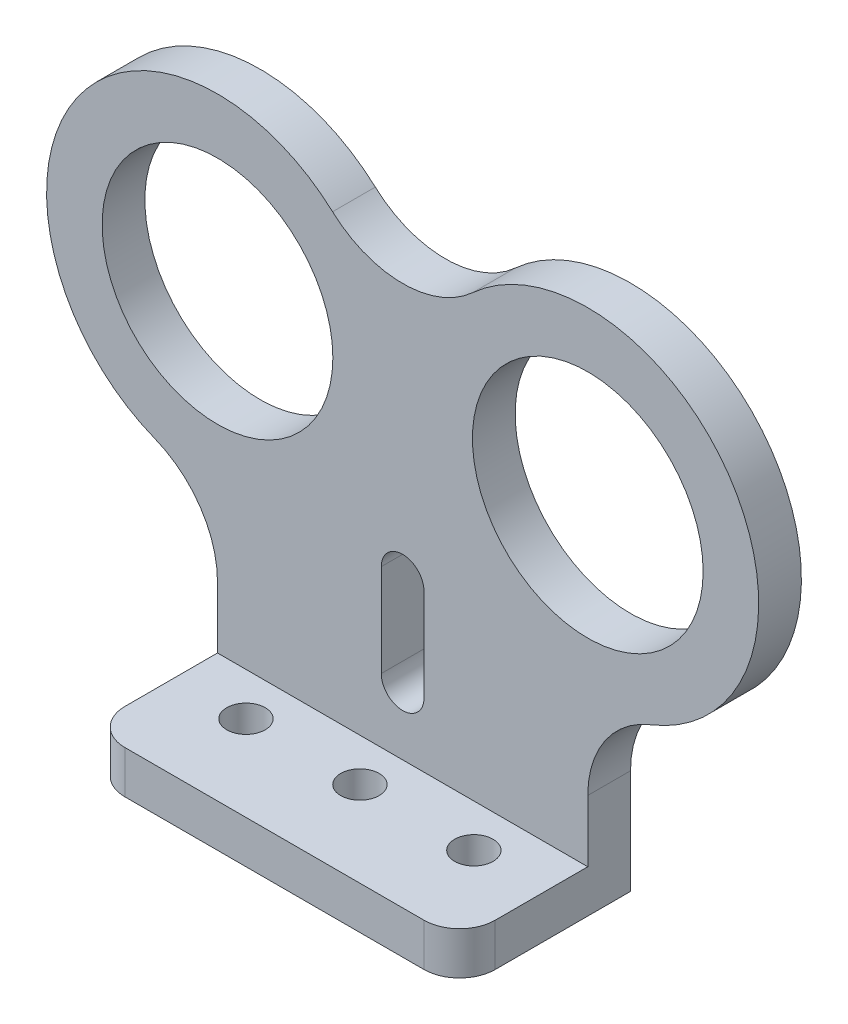
ISO-10303-21;
HEADER;
FILE_DESCRIPTION(('STEP AP214'),'2;1');
FILE_NAME('part.step','',(''),(''),'','','');
FILE_SCHEMA(('AUTOMOTIVE_DESIGN { 1 0 10303 214 1 1 1 1 }'));
ENDSEC;
DATA;
#1=APPLICATION_CONTEXT('core data for automotive mechanical design processes');
#2=APPLICATION_PROTOCOL_DEFINITION('international standard','automotive_design',2000,#1);
#3=PRODUCT_CONTEXT('',#1,'mechanical');
#4=PRODUCT('Part','Part','',(#3));
#5=PRODUCT_RELATED_PRODUCT_CATEGORY('part','',(#4));
#6=PRODUCT_DEFINITION_FORMATION('','',#4);
#7=PRODUCT_DEFINITION_CONTEXT('part definition',#1,'design');
#8=PRODUCT_DEFINITION('design','',#6,#7);
#9=PRODUCT_DEFINITION_SHAPE('','',#8);
#10=(LENGTH_UNIT() NAMED_UNIT(*) SI_UNIT(.MILLI.,.METRE.));
#11=(NAMED_UNIT(*) PLANE_ANGLE_UNIT() SI_UNIT($,.RADIAN.));
#12=(NAMED_UNIT(*) SI_UNIT($,.STERADIAN.) SOLID_ANGLE_UNIT());
#13=UNCERTAINTY_MEASURE_WITH_UNIT(LENGTH_MEASURE(1.E-05),#10,'distance_accuracy_value','');
#14=(GEOMETRIC_REPRESENTATION_CONTEXT(3) GLOBAL_UNCERTAINTY_ASSIGNED_CONTEXT((#13)) GLOBAL_UNIT_ASSIGNED_CONTEXT((#10,
#11,#12)) REPRESENTATION_CONTEXT('',''));
#15=CARTESIAN_POINT('',(0.,0.,0.));
#16=DIRECTION('',(0.,0.,1.));
#17=DIRECTION('',(1.,0.,0.));
#18=AXIS2_PLACEMENT_3D('',#15,#16,#17);
#19=CARTESIAN_POINT('',(0.,0.,3.));
#20=DIRECTION('',(0.,0.,1.));
#21=DIRECTION('',(1.,0.,0.));
#22=AXIS2_PLACEMENT_3D('',#19,#20,#21);
#23=PLANE('',#22);
#24=CARTESIAN_POINT('',(0.,7.5,3.));
#25=DIRECTION('',(0.,0.,1.));
#26=DIRECTION('',(1.,0.,0.));
#27=AXIS2_PLACEMENT_3D('',#24,#25,#26);
#28=CIRCLE('',#27,1.5);
#29=CARTESIAN_POINT('',(-1.5,7.5,3.));
#30=VERTEX_POINT('',#29);
#31=CARTESIAN_POINT('',(1.5,7.5,3.));
#32=VERTEX_POINT('',#31);
#33=EDGE_CURVE('E245',#30,#32,#28,.T.);
#34=ORIENTED_EDGE('',*,*,#33,.F.);
#35=DIRECTION('',(0.,-1.,0.));
#36=VECTOR('',#35,1.);
#37=CARTESIAN_POINT('',(-1.5,0.,3.));
#38=LINE('',#37,#36);
#39=CARTESIAN_POINT('',(-1.5,14.,3.));
#40=VERTEX_POINT('',#39);
#41=EDGE_CURVE('E276',#40,#30,#38,.T.);
#42=ORIENTED_EDGE('',*,*,#41,.F.);
#43=CARTESIAN_POINT('',(0.,14.,3.));
#44=DIRECTION('',(0.,0.,1.));
#45=DIRECTION('',(1.,0.,0.));
#46=AXIS2_PLACEMENT_3D('',#43,#44,#45);
#47=CIRCLE('',#46,1.5);
#48=CARTESIAN_POINT('',(1.5,14.,3.));
#49=VERTEX_POINT('',#48);
#50=EDGE_CURVE('E285',#49,#40,#47,.T.);
#51=ORIENTED_EDGE('',*,*,#50,.F.);
#52=DIRECTION('',(0.,-1.,0.));
#53=VECTOR('',#52,1.);
#54=CARTESIAN_POINT('',(1.5,0.,3.));
#55=LINE('',#54,#53);
#56=EDGE_CURVE('E287',#49,#32,#55,.T.);
#57=ORIENTED_EDGE('',*,*,#56,.T.);
#58=EDGE_LOOP('',(#34,#42,#51,#57));
#59=FACE_BOUND('',#58,.T.);
#60=CARTESIAN_POINT('',(13.,25.,3.));
#61=DIRECTION('',(0.,0.,1.));
#62=DIRECTION('',(1.,0.,0.));
#63=AXIS2_PLACEMENT_3D('',#60,#61,#62);
#64=CIRCLE('',#63,8.10000000000002);
#65=CARTESIAN_POINT('',(21.1,25.,3.));
#66=VERTEX_POINT('',#65);
#67=EDGE_CURVE('E183',#66,#66,#64,.T.);
#68=ORIENTED_EDGE('',*,*,#67,.F.);
#69=EDGE_LOOP('',(#68));
#70=FACE_BOUND('',#69,.T.);
#71=CARTESIAN_POINT('',(-13.,25.,3.));
#72=DIRECTION('',(0.,0.,1.));
#73=DIRECTION('',(1.,0.,0.));
#74=AXIS2_PLACEMENT_3D('',#71,#72,#73);
#75=CIRCLE('',#74,8.10000000000002);
#76=CARTESIAN_POINT('',(-4.89999999999998,25.,3.));
#77=VERTEX_POINT('',#76);
#78=EDGE_CURVE('E187',#77,#77,#75,.F.);
#79=ORIENTED_EDGE('',*,*,#78,.T.);
#80=EDGE_LOOP('',(#79));
#81=FACE_BOUND('',#80,.T.);
#82=DIRECTION('',(0.,-1.,0.));
#83=VECTOR('',#82,1.);
#84=CARTESIAN_POINT('',(-13.,0.,3.));
#85=LINE('',#84,#83);
#86=CARTESIAN_POINT('',(-13.,7.3364782673443,3.));
#87=VERTEX_POINT('',#86);
#88=CARTESIAN_POINT('',(-13.,3.,3.));
#89=VERTEX_POINT('',#88);
#90=EDGE_CURVE('E165',#87,#89,#85,.T.);
#91=ORIENTED_EDGE('',*,*,#90,.T.);
#92=DIRECTION('',(1.,0.,0.));
#93=VECTOR('',#92,1.);
#94=CARTESIAN_POINT('',(-13.,3.,3.));
#95=LINE('',#94,#93);
#96=CARTESIAN_POINT('',(13.,3.,3.));
#97=VERTEX_POINT('',#96);
#98=EDGE_CURVE('E320',#89,#97,#95,.T.);
#99=ORIENTED_EDGE('',*,*,#98,.T.);
#100=DIRECTION('',(0.,-1.,0.));
#101=VECTOR('',#100,1.);
#102=CARTESIAN_POINT('',(13.,0.,3.));
#103=LINE('',#102,#101);
#104=CARTESIAN_POINT('',(13.,7.3364782673443,3.));
#105=VERTEX_POINT('',#104);
#106=EDGE_CURVE('E180',#105,#97,#103,.T.);
#107=ORIENTED_EDGE('',*,*,#106,.F.);
#108=CARTESIAN_POINT('',(20.,7.3364782673443,3.));
#109=DIRECTION('',(0.,0.,1.));
#110=DIRECTION('',(1.,0.,0.));
#111=AXIS2_PLACEMENT_3D('',#108,#109,#110);
#112=CIRCLE('',#111,7.);
#113=CARTESIAN_POINT('',(17.4210526315789,13.8440915372701,3.));
#114=VERTEX_POINT('',#113);
#115=EDGE_CURVE('E291',#114,#105,#112,.T.);
#116=ORIENTED_EDGE('',*,*,#115,.F.);
#117=CARTESIAN_POINT('',(13.,25.,3.));
#118=DIRECTION('',(0.,0.,1.));
#119=DIRECTION('',(1.,0.,0.));
#120=AXIS2_PLACEMENT_3D('',#117,#118,#119);
#121=CIRCLE('',#120,12.);
#122=CARTESIAN_POINT('',(4.91854653723055,33.8707446096194,3.));
#123=VERTEX_POINT('',#122);
#124=EDGE_CURVE('E174',#123,#114,#121,.F.);
#125=ORIENTED_EDGE('',*,*,#124,.F.);
#126=CARTESIAN_POINT('',(0.,39.2696707289499,3.));
#127=DIRECTION('',(0.,0.,1.));
#128=DIRECTION('',(1.,0.,0.));
#129=AXIS2_PLACEMENT_3D('',#126,#127,#128);
#130=CIRCLE('',#129,7.30345830965661);
#131=CARTESIAN_POINT('',(-4.91854653723055,33.8707446096194,3.));
#132=VERTEX_POINT('',#131);
#133=EDGE_CURVE('E170',#132,#123,#130,.T.);
#134=ORIENTED_EDGE('',*,*,#133,.F.);
#135=CARTESIAN_POINT('',(-13.,25.,3.));
#136=DIRECTION('',(0.,0.,1.));
#137=DIRECTION('',(1.,0.,0.));
#138=AXIS2_PLACEMENT_3D('',#135,#136,#137);
#139=CIRCLE('',#138,12.);
#140=CARTESIAN_POINT('',(-17.4210526315789,13.8440915372701,3.));
#141=VERTEX_POINT('',#140);
#142=EDGE_CURVE('E147',#141,#132,#139,.F.);
#143=ORIENTED_EDGE('',*,*,#142,.F.);
#144=CARTESIAN_POINT('',(-20.,7.3364782673443,3.));
#145=DIRECTION('',(0.,0.,1.));
#146=DIRECTION('',(1.,0.,0.));
#147=AXIS2_PLACEMENT_3D('',#144,#145,#146);
#148=CIRCLE('',#147,7.);
#149=EDGE_CURVE('E159',#141,#87,#148,.F.);
#150=ORIENTED_EDGE('',*,*,#149,.T.);
#151=EDGE_LOOP('',(#91,#99,#107,#116,#125,#134,#143,#150));
#152=FACE_BOUND('',#151,.T.);
#153=ADVANCED_FACE('F41',(#59,#70,#81,#152),#23,.T.);
#154=CARTESIAN_POINT('',(20.,7.3364782673443,3.));
#155=DIRECTION('',(0.,0.,-1.));
#156=DIRECTION('',(-1.,0.,0.));
#157=AXIS2_PLACEMENT_3D('',#154,#155,#156);
#158=CYLINDRICAL_SURFACE('',#157,7.);
#159=CARTESIAN_POINT('',(20.,7.3364782673443,0.));
#160=DIRECTION('',(0.,0.,1.));
#161=DIRECTION('',(1.,0.,0.));
#162=AXIS2_PLACEMENT_3D('',#159,#160,#161);
#163=CIRCLE('',#162,7.);
#164=CARTESIAN_POINT('',(17.4210526315789,13.8440915372701,0.));
#165=VERTEX_POINT('',#164);
#166=CARTESIAN_POINT('',(13.,7.3364782673443,0.));
#167=VERTEX_POINT('',#166);
#168=EDGE_CURVE('E209',#165,#167,#163,.T.);
#169=ORIENTED_EDGE('',*,*,#168,.F.);
#170=DIRECTION('',(0.,0.,-1.));
#171=VECTOR('',#170,1.);
#172=CARTESIAN_POINT('',(17.4210526315789,13.8440915372701,3.));
#173=LINE('',#172,#171);
#174=EDGE_CURVE('E11',#114,#165,#173,.T.);
#175=ORIENTED_EDGE('',*,*,#174,.F.);
#176=ORIENTED_EDGE('',*,*,#115,.T.);
#177=DIRECTION('',(0.,0.,-1.));
#178=VECTOR('',#177,1.);
#179=CARTESIAN_POINT('',(13.,7.3364782673443,3.));
#180=LINE('',#179,#178);
#181=EDGE_CURVE('E68',#105,#167,#180,.T.);
#182=ORIENTED_EDGE('',*,*,#181,.T.);
#183=EDGE_LOOP('',(#169,#175,#176,#182));
#184=FACE_BOUND('',#183,.T.);
#185=ADVANCED_FACE('F453',(#184),#158,.F.);
#186=CARTESIAN_POINT('',(13.,25.,3.));
#187=DIRECTION('',(0.,0.,-1.));
#188=DIRECTION('',(-1.,0.,0.));
#189=AXIS2_PLACEMENT_3D('',#186,#187,#188);
#190=CYLINDRICAL_SURFACE('',#189,12.);
#191=CARTESIAN_POINT('',(13.,25.,0.));
#192=DIRECTION('',(0.,0.,1.));
#193=DIRECTION('',(1.,0.,0.));
#194=AXIS2_PLACEMENT_3D('',#191,#192,#193);
#195=CIRCLE('',#194,12.);
#196=CARTESIAN_POINT('',(4.91854653723055,33.8707446096194,0.));
#197=VERTEX_POINT('',#196);
#198=EDGE_CURVE('E212',#197,#165,#195,.F.);
#199=ORIENTED_EDGE('',*,*,#198,.F.);
#200=DIRECTION('',(0.,0.,-1.));
#201=VECTOR('',#200,1.);
#202=CARTESIAN_POINT('',(4.91854653723055,33.8707446096194,3.));
#203=LINE('',#202,#201);
#204=EDGE_CURVE('E51',#123,#197,#203,.T.);
#205=ORIENTED_EDGE('',*,*,#204,.F.);
#206=ORIENTED_EDGE('',*,*,#124,.T.);
#207=ORIENTED_EDGE('',*,*,#174,.T.);
#208=EDGE_LOOP('',(#199,#205,#206,#207));
#209=FACE_BOUND('',#208,.T.);
#210=ADVANCED_FACE('F305',(#209),#190,.T.);
#211=CARTESIAN_POINT('',(0.,39.2696707289499,3.));
#212=DIRECTION('',(0.,0.,-1.));
#213=DIRECTION('',(-1.,0.,0.));
#214=AXIS2_PLACEMENT_3D('',#211,#212,#213);
#215=CYLINDRICAL_SURFACE('',#214,7.30345830965661);
#216=CARTESIAN_POINT('',(0.,39.2696707289499,0.));
#217=DIRECTION('',(0.,0.,1.));
#218=DIRECTION('',(1.,0.,0.));
#219=AXIS2_PLACEMENT_3D('',#216,#217,#218);
#220=CIRCLE('',#219,7.30345830965661);
#221=CARTESIAN_POINT('',(-4.91854653723055,33.8707446096194,0.));
#222=VERTEX_POINT('',#221);
#223=EDGE_CURVE('E216',#222,#197,#220,.T.);
#224=ORIENTED_EDGE('',*,*,#223,.F.);
#225=DIRECTION('',(0.,0.,-1.));
#226=VECTOR('',#225,1.);
#227=CARTESIAN_POINT('',(-4.91854653723055,33.8707446096194,3.));
#228=LINE('',#227,#226);
#229=EDGE_CURVE('E154',#132,#222,#228,.T.);
#230=ORIENTED_EDGE('',*,*,#229,.F.);
#231=ORIENTED_EDGE('',*,*,#133,.T.);
#232=ORIENTED_EDGE('',*,*,#204,.T.);
#233=EDGE_LOOP('',(#224,#230,#231,#232));
#234=FACE_BOUND('',#233,.T.);
#235=ADVANCED_FACE('F310',(#234),#215,.F.);
#236=CARTESIAN_POINT('',(-13.,25.,3.));
#237=DIRECTION('',(0.,0.,-1.));
#238=DIRECTION('',(-1.,0.,0.));
#239=AXIS2_PLACEMENT_3D('',#236,#237,#238);
#240=CYLINDRICAL_SURFACE('',#239,12.);
#241=CARTESIAN_POINT('',(-13.,25.,0.));
#242=DIRECTION('',(0.,0.,1.));
#243=DIRECTION('',(1.,0.,0.));
#244=AXIS2_PLACEMENT_3D('',#241,#242,#243);
#245=CIRCLE('',#244,12.);
#246=CARTESIAN_POINT('',(-17.4210526315789,13.8440915372701,0.));
#247=VERTEX_POINT('',#246);
#248=EDGE_CURVE('E149',#247,#222,#245,.F.);
#249=ORIENTED_EDGE('',*,*,#248,.F.);
#250=DIRECTION('',(0.,0.,-1.));
#251=VECTOR('',#250,1.);
#252=CARTESIAN_POINT('',(-17.4210526315789,13.8440915372701,3.));
#253=LINE('',#252,#251);
#254=EDGE_CURVE('E143',#141,#247,#253,.T.);
#255=ORIENTED_EDGE('',*,*,#254,.F.);
#256=ORIENTED_EDGE('',*,*,#142,.T.);
#257=ORIENTED_EDGE('',*,*,#229,.T.);
#258=EDGE_LOOP('',(#249,#255,#256,#257));
#259=FACE_BOUND('',#258,.T.);
#260=ADVANCED_FACE('F145',(#259),#240,.T.);
#261=CARTESIAN_POINT('',(-20.,7.3364782673443,3.));
#262=DIRECTION('',(0.,0.,-1.));
#263=DIRECTION('',(-1.,0.,0.));
#264=AXIS2_PLACEMENT_3D('',#261,#262,#263);
#265=CYLINDRICAL_SURFACE('',#264,7.);
#266=CARTESIAN_POINT('',(-20.,7.3364782673443,0.));
#267=DIRECTION('',(0.,0.,1.));
#268=DIRECTION('',(1.,0.,0.));
#269=AXIS2_PLACEMENT_3D('',#266,#267,#268);
#270=CIRCLE('',#269,7.);
#271=CARTESIAN_POINT('',(-13.,7.3364782673443,0.));
#272=VERTEX_POINT('',#271);
#273=EDGE_CURVE('E222',#247,#272,#270,.F.);
#274=ORIENTED_EDGE('',*,*,#273,.T.);
#275=DIRECTION('',(0.,0.,-1.));
#276=VECTOR('',#275,1.);
#277=CARTESIAN_POINT('',(-13.,7.3364782673443,3.));
#278=LINE('',#277,#276);
#279=EDGE_CURVE('E155',#87,#272,#278,.T.);
#280=ORIENTED_EDGE('',*,*,#279,.F.);
#281=ORIENTED_EDGE('',*,*,#149,.F.);
#282=ORIENTED_EDGE('',*,*,#254,.T.);
#283=EDGE_LOOP('',(#274,#280,#281,#282));
#284=FACE_BOUND('',#283,.T.);
#285=ADVANCED_FACE('F160',(#284),#265,.F.);
#286=CARTESIAN_POINT('',(-13.,0.,3.));
#287=DIRECTION('',(1.,0.,0.));
#288=DIRECTION('',(0.,1.,0.));
#289=AXIS2_PLACEMENT_3D('',#286,#287,#288);
#290=PLANE('',#289);
#291=DIRECTION('',(0.,-1.,0.));
#292=VECTOR('',#291,1.);
#293=CARTESIAN_POINT('',(-13.,0.,0.));
#294=LINE('',#293,#292);
#295=CARTESIAN_POINT('',(-13.,0.,0.));
#296=VERTEX_POINT('',#295);
#297=EDGE_CURVE('E225',#272,#296,#294,.T.);
#298=ORIENTED_EDGE('',*,*,#297,.T.);
#299=DIRECTION('',(0.,0.,-1.));
#300=VECTOR('',#299,1.);
#301=CARTESIAN_POINT('',(-13.,0.,3.));
#302=LINE('',#301,#300);
#303=CARTESIAN_POINT('',(-13.,0.,9.49999999999998));
#304=VERTEX_POINT('',#303);
#305=EDGE_CURVE('E251',#304,#296,#302,.T.);
#306=ORIENTED_EDGE('',*,*,#305,.F.);
#307=DIRECTION('',(0.,-1.,0.));
#308=VECTOR('',#307,1.);
#309=CARTESIAN_POINT('',(-13.,3.,9.49999999999998));
#310=LINE('',#309,#308);
#311=CARTESIAN_POINT('',(-13.,3.,9.49999999999998));
#312=VERTEX_POINT('',#311);
#313=EDGE_CURVE('E197',#312,#304,#310,.T.);
#314=ORIENTED_EDGE('',*,*,#313,.F.);
#315=DIRECTION('',(0.,0.,-1.));
#316=VECTOR('',#315,1.);
#317=CARTESIAN_POINT('',(-13.,3.,3.));
#318=LINE('',#317,#316);
#319=EDGE_CURVE('E319',#312,#89,#318,.T.);
#320=ORIENTED_EDGE('',*,*,#319,.T.);
#321=ORIENTED_EDGE('',*,*,#90,.F.);
#322=ORIENTED_EDGE('',*,*,#279,.T.);
#323=EDGE_LOOP('',(#298,#306,#314,#320,#321,#322));
#324=FACE_BOUND('',#323,.T.);
#325=ADVANCED_FACE('F314',(#324),#290,.F.);
#326=CARTESIAN_POINT('',(0.,0.,3.));
#327=DIRECTION('',(0.,1.,0.));
#328=DIRECTION('',(-1.,0.,0.));
#329=AXIS2_PLACEMENT_3D('',#326,#327,#328);
#330=PLANE('',#329);
#331=DIRECTION('',(1.,0.,0.));
#332=VECTOR('',#331,1.);
#333=CARTESIAN_POINT('',(0.,0.,0.));
#334=LINE('',#333,#332);
#335=CARTESIAN_POINT('',(13.,0.,0.));
#336=VERTEX_POINT('',#335);
#337=EDGE_CURVE('E229',#296,#336,#334,.T.);
#338=ORIENTED_EDGE('',*,*,#337,.T.);
#339=DIRECTION('',(0.,0.,-1.));
#340=VECTOR('',#339,1.);
#341=CARTESIAN_POINT('',(13.,0.,3.));
#342=LINE('',#341,#340);
#343=CARTESIAN_POINT('',(13.,0.,9.49999999999998));
#344=VERTEX_POINT('',#343);
#345=EDGE_CURVE('E248',#344,#336,#342,.T.);
#346=ORIENTED_EDGE('',*,*,#345,.F.);
#347=CARTESIAN_POINT('',(10.5,0.,9.5));
#348=DIRECTION('',(0.,-1.,0.));
#349=DIRECTION('',(-1.,0.,0.));
#350=AXIS2_PLACEMENT_3D('',#347,#348,#349);
#351=CIRCLE('',#350,2.5);
#352=CARTESIAN_POINT('',(10.5,0.,12.));
#353=VERTEX_POINT('',#352);
#354=EDGE_CURVE('E363',#344,#353,#351,.T.);
#355=ORIENTED_EDGE('',*,*,#354,.T.);
#356=DIRECTION('',(-1.,0.,0.));
#357=VECTOR('',#356,1.);
#358=CARTESIAN_POINT('',(-10.5,0.,12.));
#359=LINE('',#358,#357);
#360=CARTESIAN_POINT('',(-10.5,0.,12.));
#361=VERTEX_POINT('',#360);
#362=EDGE_CURVE('E346',#353,#361,#359,.T.);
#363=ORIENTED_EDGE('',*,*,#362,.T.);
#364=CARTESIAN_POINT('',(-10.5,0.,9.5));
#365=DIRECTION('',(0.,-1.,0.));
#366=DIRECTION('',(-1.,0.,0.));
#367=AXIS2_PLACEMENT_3D('',#364,#365,#366);
#368=CIRCLE('',#367,2.5);
#369=EDGE_CURVE('E361',#361,#304,#368,.T.);
#370=ORIENTED_EDGE('',*,*,#369,.T.);
#371=ORIENTED_EDGE('',*,*,#305,.T.);
#372=EDGE_LOOP('',(#338,#346,#355,#363,#370,#371));
#373=FACE_BOUND('',#372,.T.);
#374=CARTESIAN_POINT('',(0.,0.,6.));
#375=DIRECTION('',(0.,-1.,0.));
#376=DIRECTION('',(1.,0.,0.));
#377=AXIS2_PLACEMENT_3D('',#374,#375,#376);
#378=CIRCLE('',#377,1.35);
#379=CARTESIAN_POINT('',(1.35,0.,6.));
#380=VERTEX_POINT('',#379);
#381=EDGE_CURVE('E416',#380,#380,#378,.T.);
#382=ORIENTED_EDGE('',*,*,#381,.F.);
#383=EDGE_LOOP('',(#382));
#384=FACE_BOUND('',#383,.T.);
#385=CARTESIAN_POINT('',(-8.,0.,6.));
#386=DIRECTION('',(0.,-1.,0.));
#387=DIRECTION('',(-1.,0.,0.));
#388=AXIS2_PLACEMENT_3D('',#385,#386,#387);
#389=CIRCLE('',#388,1.35);
#390=CARTESIAN_POINT('',(-9.35,0.,6.));
#391=VERTEX_POINT('',#390);
#392=EDGE_CURVE('E408',#391,#391,#389,.T.);
#393=ORIENTED_EDGE('',*,*,#392,.F.);
#394=EDGE_LOOP('',(#393));
#395=FACE_BOUND('',#394,.T.);
#396=CARTESIAN_POINT('',(8.,0.,6.));
#397=DIRECTION('',(0.,-1.,0.));
#398=DIRECTION('',(1.,0.,0.));
#399=AXIS2_PLACEMENT_3D('',#396,#397,#398);
#400=CIRCLE('',#399,1.35);
#401=CARTESIAN_POINT('',(9.35,0.,6.));
#402=VERTEX_POINT('',#401);
#403=EDGE_CURVE('E400',#402,#402,#400,.T.);
#404=ORIENTED_EDGE('',*,*,#403,.F.);
#405=EDGE_LOOP('',(#404));
#406=FACE_BOUND('',#405,.T.);
#407=ADVANCED_FACE('F359',(#373,#384,#395,#406),#330,.F.);
#408=CARTESIAN_POINT('',(0.,7.5,3.));
#409=DIRECTION('',(0.,0.,-1.));
#410=DIRECTION('',(-1.,0.,0.));
#411=AXIS2_PLACEMENT_3D('',#408,#409,#410);
#412=CYLINDRICAL_SURFACE('',#411,1.5);
#413=CARTESIAN_POINT('',(0.,7.5,0.));
#414=DIRECTION('',(0.,0.,1.));
#415=DIRECTION('',(1.,0.,0.));
#416=AXIS2_PLACEMENT_3D('',#413,#414,#415);
#417=CIRCLE('',#416,1.5);
#418=CARTESIAN_POINT('',(-1.5,7.5,0.));
#419=VERTEX_POINT('',#418);
#420=CARTESIAN_POINT('',(1.5,7.5,0.));
#421=VERTEX_POINT('',#420);
#422=EDGE_CURVE('E192',#419,#421,#417,.T.);
#423=ORIENTED_EDGE('',*,*,#422,.F.);
#424=DIRECTION('',(0.,0.,-1.));
#425=VECTOR('',#424,1.);
#426=CARTESIAN_POINT('',(-1.5,7.5,3.));
#427=LINE('',#426,#425);
#428=EDGE_CURVE('E45',#30,#419,#427,.T.);
#429=ORIENTED_EDGE('',*,*,#428,.F.);
#430=ORIENTED_EDGE('',*,*,#33,.T.);
#431=DIRECTION('',(0.,0.,-1.));
#432=VECTOR('',#431,1.);
#433=CARTESIAN_POINT('',(1.5,7.5,3.));
#434=LINE('',#433,#432);
#435=EDGE_CURVE('E191',#32,#421,#434,.T.);
#436=ORIENTED_EDGE('',*,*,#435,.T.);
#437=EDGE_LOOP('',(#423,#429,#430,#436));
#438=FACE_BOUND('',#437,.T.);
#439=ADVANCED_FACE('F43',(#438),#412,.F.);
#440=CARTESIAN_POINT('',(-1.5,0.,3.));
#441=DIRECTION('',(1.,0.,0.));
#442=DIRECTION('',(0.,1.,0.));
#443=AXIS2_PLACEMENT_3D('',#440,#441,#442);
#444=PLANE('',#443);
#445=DIRECTION('',(0.,-1.,0.));
#446=VECTOR('',#445,1.);
#447=CARTESIAN_POINT('',(-1.5,0.,0.));
#448=LINE('',#447,#446);
#449=CARTESIAN_POINT('',(-1.5,14.,0.));
#450=VERTEX_POINT('',#449);
#451=EDGE_CURVE('E196',#450,#419,#448,.T.);
#452=ORIENTED_EDGE('',*,*,#451,.F.);
#453=DIRECTION('',(0.,0.,-1.));
#454=VECTOR('',#453,1.);
#455=CARTESIAN_POINT('',(-1.5,14.,3.));
#456=LINE('',#455,#454);
#457=EDGE_CURVE('E265',#40,#450,#456,.T.);
#458=ORIENTED_EDGE('',*,*,#457,.F.);
#459=ORIENTED_EDGE('',*,*,#41,.T.);
#460=ORIENTED_EDGE('',*,*,#428,.T.);
#461=EDGE_LOOP('',(#452,#458,#459,#460));
#462=FACE_BOUND('',#461,.T.);
#463=ADVANCED_FACE('F274',(#462),#444,.T.);
#464=CARTESIAN_POINT('',(0.,14.,3.));
#465=DIRECTION('',(0.,0.,-1.));
#466=DIRECTION('',(-1.,0.,0.));
#467=AXIS2_PLACEMENT_3D('',#464,#465,#466);
#468=CYLINDRICAL_SURFACE('',#467,1.5);
#469=CARTESIAN_POINT('',(0.,14.,0.));
#470=DIRECTION('',(0.,0.,1.));
#471=DIRECTION('',(1.,0.,0.));
#472=AXIS2_PLACEMENT_3D('',#469,#470,#471);
#473=CIRCLE('',#472,1.5);
#474=CARTESIAN_POINT('',(1.5,14.,0.));
#475=VERTEX_POINT('',#474);
#476=EDGE_CURVE('E201',#475,#450,#473,.T.);
#477=ORIENTED_EDGE('',*,*,#476,.F.);
#478=DIRECTION('',(0.,0.,-1.));
#479=VECTOR('',#478,1.);
#480=CARTESIAN_POINT('',(1.5,14.,3.));
#481=LINE('',#480,#479);
#482=EDGE_CURVE('E263',#49,#475,#481,.T.);
#483=ORIENTED_EDGE('',*,*,#482,.F.);
#484=ORIENTED_EDGE('',*,*,#50,.T.);
#485=ORIENTED_EDGE('',*,*,#457,.T.);
#486=EDGE_LOOP('',(#477,#483,#484,#485));
#487=FACE_BOUND('',#486,.T.);
#488=ADVANCED_FACE('F282',(#487),#468,.F.);
#489=CARTESIAN_POINT('',(13.,25.,3.));
#490=DIRECTION('',(0.,0.,-1.));
#491=DIRECTION('',(-1.,0.,0.));
#492=AXIS2_PLACEMENT_3D('',#489,#490,#491);
#493=CYLINDRICAL_SURFACE('',#492,8.10000000000002);
#494=ORIENTED_EDGE('',*,*,#67,.T.);
#495=EDGE_LOOP('',(#494));
#496=FACE_BOUND('',#495,.T.);
#497=CARTESIAN_POINT('',(13.,25.,0.));
#498=DIRECTION('',(0.,0.,1.));
#499=DIRECTION('',(1.,0.,0.));
#500=AXIS2_PLACEMENT_3D('',#497,#498,#499);
#501=CIRCLE('',#500,8.10000000000002);
#502=CARTESIAN_POINT('',(21.1,25.,0.));
#503=VERTEX_POINT('',#502);
#504=EDGE_CURVE('E237',#503,#503,#501,.T.);
#505=ORIENTED_EDGE('',*,*,#504,.F.);
#506=EDGE_LOOP('',(#505));
#507=FACE_BOUND('',#506,.T.);
#508=ADVANCED_FACE('F468',(#496,#507),#493,.F.);
#509=CARTESIAN_POINT('',(13.,0.,3.));
#510=DIRECTION('',(1.,0.,0.));
#511=DIRECTION('',(0.,1.,0.));
#512=AXIS2_PLACEMENT_3D('',#509,#510,#511);
#513=PLANE('',#512);
#514=DIRECTION('',(0.,-1.,0.));
#515=VECTOR('',#514,1.);
#516=CARTESIAN_POINT('',(13.,0.,0.));
#517=LINE('',#516,#515);
#518=EDGE_CURVE('E233',#167,#336,#517,.T.);
#519=ORIENTED_EDGE('',*,*,#518,.F.);
#520=ORIENTED_EDGE('',*,*,#181,.F.);
#521=ORIENTED_EDGE('',*,*,#106,.T.);
#522=DIRECTION('',(0.,0.,1.));
#523=VECTOR('',#522,1.);
#524=CARTESIAN_POINT('',(13.,3.,3.));
#525=LINE('',#524,#523);
#526=CARTESIAN_POINT('',(13.,3.,9.49999999999998));
#527=VERTEX_POINT('',#526);
#528=EDGE_CURVE('E59',#97,#527,#525,.T.);
#529=ORIENTED_EDGE('',*,*,#528,.T.);
#530=DIRECTION('',(0.,-1.,0.));
#531=VECTOR('',#530,1.);
#532=CARTESIAN_POINT('',(13.,3.,9.49999999999998));
#533=LINE('',#532,#531);
#534=EDGE_CURVE('E378',#527,#344,#533,.T.);
#535=ORIENTED_EDGE('',*,*,#534,.T.);
#536=ORIENTED_EDGE('',*,*,#345,.T.);
#537=EDGE_LOOP('',(#519,#520,#521,#529,#535,#536));
#538=FACE_BOUND('',#537,.T.);
#539=ADVANCED_FACE('F471',(#538),#513,.T.);
#540=CARTESIAN_POINT('',(1.5,0.,3.));
#541=DIRECTION('',(1.,0.,0.));
#542=DIRECTION('',(0.,1.,0.));
#543=AXIS2_PLACEMENT_3D('',#540,#541,#542);
#544=PLANE('',#543);
#545=DIRECTION('',(0.,-1.,0.));
#546=VECTOR('',#545,1.);
#547=CARTESIAN_POINT('',(1.5,0.,0.));
#548=LINE('',#547,#546);
#549=EDGE_CURVE('E205',#475,#421,#548,.T.);
#550=ORIENTED_EDGE('',*,*,#549,.T.);
#551=ORIENTED_EDGE('',*,*,#435,.F.);
#552=ORIENTED_EDGE('',*,*,#56,.F.);
#553=ORIENTED_EDGE('',*,*,#482,.T.);
#554=EDGE_LOOP('',(#550,#551,#552,#553));
#555=FACE_BOUND('',#554,.T.);
#556=ADVANCED_FACE('F288',(#555),#544,.F.);
#557=CARTESIAN_POINT('',(-13.,25.,3.));
#558=DIRECTION('',(0.,0.,-1.));
#559=DIRECTION('',(-1.,0.,0.));
#560=AXIS2_PLACEMENT_3D('',#557,#558,#559);
#561=CYLINDRICAL_SURFACE('',#560,8.10000000000002);
#562=ORIENTED_EDGE('',*,*,#78,.F.);
#563=EDGE_LOOP('',(#562));
#564=FACE_BOUND('',#563,.T.);
#565=CARTESIAN_POINT('',(-13.,25.,0.));
#566=DIRECTION('',(0.,0.,1.));
#567=DIRECTION('',(1.,0.,0.));
#568=AXIS2_PLACEMENT_3D('',#565,#566,#567);
#569=CIRCLE('',#568,8.10000000000002);
#570=CARTESIAN_POINT('',(-4.89999999999998,25.,0.));
#571=VERTEX_POINT('',#570);
#572=EDGE_CURVE('E241',#571,#571,#569,.F.);
#573=ORIENTED_EDGE('',*,*,#572,.T.);
#574=EDGE_LOOP('',(#573));
#575=FACE_BOUND('',#574,.T.);
#576=ADVANCED_FACE('F464',(#564,#575),#561,.F.);
#577=CARTESIAN_POINT('',(0.,0.,0.));
#578=DIRECTION('',(0.,0.,1.));
#579=DIRECTION('',(1.,0.,0.));
#580=AXIS2_PLACEMENT_3D('',#577,#578,#579);
#581=PLANE('',#580);
#582=ORIENTED_EDGE('',*,*,#422,.T.);
#583=ORIENTED_EDGE('',*,*,#549,.F.);
#584=ORIENTED_EDGE('',*,*,#476,.T.);
#585=ORIENTED_EDGE('',*,*,#451,.T.);
#586=EDGE_LOOP('',(#582,#583,#584,#585));
#587=FACE_BOUND('',#586,.T.);
#588=ORIENTED_EDGE('',*,*,#168,.T.);
#589=ORIENTED_EDGE('',*,*,#518,.T.);
#590=ORIENTED_EDGE('',*,*,#337,.F.);
#591=ORIENTED_EDGE('',*,*,#297,.F.);
#592=ORIENTED_EDGE('',*,*,#273,.F.);
#593=ORIENTED_EDGE('',*,*,#248,.T.);
#594=ORIENTED_EDGE('',*,*,#223,.T.);
#595=ORIENTED_EDGE('',*,*,#198,.T.);
#596=EDGE_LOOP('',(#588,#589,#590,#591,#592,#593,#594,#595));
#597=FACE_BOUND('',#596,.T.);
#598=ORIENTED_EDGE('',*,*,#504,.T.);
#599=EDGE_LOOP('',(#598));
#600=FACE_BOUND('',#599,.T.);
#601=ORIENTED_EDGE('',*,*,#572,.F.);
#602=EDGE_LOOP('',(#601));
#603=FACE_BOUND('',#602,.T.);
#604=ADVANCED_FACE('F280',(#587,#597,#600,#603),#581,.F.);
#605=CARTESIAN_POINT('',(-10.5,3.,9.5));
#606=DIRECTION('',(0.,-1.,0.));
#607=DIRECTION('',(1.,0.,0.));
#608=AXIS2_PLACEMENT_3D('',#605,#606,#607);
#609=CYLINDRICAL_SURFACE('',#608,2.5);
#610=ORIENTED_EDGE('',*,*,#369,.F.);
#611=DIRECTION('',(0.,-1.,0.));
#612=VECTOR('',#611,1.);
#613=CARTESIAN_POINT('',(-10.5,3.,12.));
#614=LINE('',#613,#612);
#615=CARTESIAN_POINT('',(-10.5,3.,12.));
#616=VERTEX_POINT('',#615);
#617=EDGE_CURVE('E343',#616,#361,#614,.T.);
#618=ORIENTED_EDGE('',*,*,#617,.F.);
#619=CARTESIAN_POINT('',(-10.5,3.,9.5));
#620=DIRECTION('',(0.,-1.,0.));
#621=DIRECTION('',(-1.,0.,0.));
#622=AXIS2_PLACEMENT_3D('',#619,#620,#621);
#623=CIRCLE('',#622,2.5);
#624=EDGE_CURVE('E381',#616,#312,#623,.T.);
#625=ORIENTED_EDGE('',*,*,#624,.T.);
#626=ORIENTED_EDGE('',*,*,#313,.T.);
#627=EDGE_LOOP('',(#610,#618,#625,#626));
#628=FACE_BOUND('',#627,.T.);
#629=ADVANCED_FACE('F367',(#628),#609,.T.);
#630=CARTESIAN_POINT('',(-10.5,3.,12.));
#631=DIRECTION('',(0.,0.,1.));
#632=DIRECTION('',(1.,0.,0.));
#633=AXIS2_PLACEMENT_3D('',#630,#631,#632);
#634=PLANE('',#633);
#635=ORIENTED_EDGE('',*,*,#362,.F.);
#636=DIRECTION('',(0.,-1.,0.));
#637=VECTOR('',#636,1.);
#638=CARTESIAN_POINT('',(10.5,3.,12.));
#639=LINE('',#638,#637);
#640=CARTESIAN_POINT('',(10.5,3.,12.));
#641=VERTEX_POINT('',#640);
#642=EDGE_CURVE('E355',#641,#353,#639,.T.);
#643=ORIENTED_EDGE('',*,*,#642,.F.);
#644=DIRECTION('',(-1.,0.,0.));
#645=VECTOR('',#644,1.);
#646=CARTESIAN_POINT('',(-10.5,3.,12.));
#647=LINE('',#646,#645);
#648=EDGE_CURVE('E349',#641,#616,#647,.T.);
#649=ORIENTED_EDGE('',*,*,#648,.T.);
#650=ORIENTED_EDGE('',*,*,#617,.T.);
#651=EDGE_LOOP('',(#635,#643,#649,#650));
#652=FACE_BOUND('',#651,.T.);
#653=ADVANCED_FACE('F345',(#652),#634,.T.);
#654=CARTESIAN_POINT('',(10.5,3.,9.5));
#655=DIRECTION('',(0.,-1.,0.));
#656=DIRECTION('',(1.,0.,0.));
#657=AXIS2_PLACEMENT_3D('',#654,#655,#656);
#658=CYLINDRICAL_SURFACE('',#657,2.5);
#659=ORIENTED_EDGE('',*,*,#354,.F.);
#660=ORIENTED_EDGE('',*,*,#534,.F.);
#661=CARTESIAN_POINT('',(10.5,3.,9.5));
#662=DIRECTION('',(0.,-1.,0.));
#663=DIRECTION('',(-1.,0.,0.));
#664=AXIS2_PLACEMENT_3D('',#661,#662,#663);
#665=CIRCLE('',#664,2.5);
#666=EDGE_CURVE('E387',#527,#641,#665,.T.);
#667=ORIENTED_EDGE('',*,*,#666,.T.);
#668=ORIENTED_EDGE('',*,*,#642,.T.);
#669=EDGE_LOOP('',(#659,#660,#667,#668));
#670=FACE_BOUND('',#669,.T.);
#671=ADVANCED_FACE('F450',(#670),#658,.T.);
#672=CARTESIAN_POINT('',(-10.5,3.,9.5));
#673=DIRECTION('',(0.,1.,0.));
#674=DIRECTION('',(-1.,0.,0.));
#675=AXIS2_PLACEMENT_3D('',#672,#673,#674);
#676=PLANE('',#675);
#677=CARTESIAN_POINT('',(0.,3.,6.));
#678=DIRECTION('',(0.,-1.,0.));
#679=DIRECTION('',(1.,0.,0.));
#680=AXIS2_PLACEMENT_3D('',#677,#678,#679);
#681=CIRCLE('',#680,1.35);
#682=CARTESIAN_POINT('',(1.35,3.,6.));
#683=VERTEX_POINT('',#682);
#684=EDGE_CURVE('E412',#683,#683,#681,.T.);
#685=ORIENTED_EDGE('',*,*,#684,.T.);
#686=EDGE_LOOP('',(#685));
#687=FACE_BOUND('',#686,.T.);
#688=CARTESIAN_POINT('',(-8.,3.,6.));
#689=DIRECTION('',(0.,-1.,0.));
#690=DIRECTION('',(-1.,0.,0.));
#691=AXIS2_PLACEMENT_3D('',#688,#689,#690);
#692=CIRCLE('',#691,1.35);
#693=CARTESIAN_POINT('',(-9.35,3.,6.));
#694=VERTEX_POINT('',#693);
#695=EDGE_CURVE('E406',#694,#694,#692,.T.);
#696=ORIENTED_EDGE('',*,*,#695,.T.);
#697=EDGE_LOOP('',(#696));
#698=FACE_BOUND('',#697,.T.);
#699=CARTESIAN_POINT('',(8.,3.,6.));
#700=DIRECTION('',(0.,-1.,0.));
#701=DIRECTION('',(1.,0.,0.));
#702=AXIS2_PLACEMENT_3D('',#699,#700,#701);
#703=CIRCLE('',#702,1.35);
#704=CARTESIAN_POINT('',(9.35,3.,6.));
#705=VERTEX_POINT('',#704);
#706=EDGE_CURVE('E397',#705,#705,#703,.T.);
#707=ORIENTED_EDGE('',*,*,#706,.T.);
#708=EDGE_LOOP('',(#707));
#709=FACE_BOUND('',#708,.T.);
#710=ORIENTED_EDGE('',*,*,#319,.F.);
#711=ORIENTED_EDGE('',*,*,#624,.F.);
#712=ORIENTED_EDGE('',*,*,#648,.F.);
#713=ORIENTED_EDGE('',*,*,#666,.F.);
#714=ORIENTED_EDGE('',*,*,#528,.F.);
#715=ORIENTED_EDGE('',*,*,#98,.F.);
#716=EDGE_LOOP('',(#710,#711,#712,#713,#714,#715));
#717=FACE_BOUND('',#716,.T.);
#718=ADVANCED_FACE('F424',(#687,#698,#709,#717),#676,.T.);
#719=CARTESIAN_POINT('',(8.,3.,6.));
#720=DIRECTION('',(0.,-1.,0.));
#721=DIRECTION('',(1.,0.,0.));
#722=AXIS2_PLACEMENT_3D('',#719,#720,#721);
#723=CYLINDRICAL_SURFACE('',#722,1.35);
#724=ORIENTED_EDGE('',*,*,#706,.F.);
#725=EDGE_LOOP('',(#724));
#726=FACE_BOUND('',#725,.T.);
#727=ORIENTED_EDGE('',*,*,#403,.T.);
#728=EDGE_LOOP('',(#727));
#729=FACE_BOUND('',#728,.T.);
#730=ADVANCED_FACE('F440',(#726,#729),#723,.F.);
#731=CARTESIAN_POINT('',(-8.,3.,6.));
#732=DIRECTION('',(0.,-1.,0.));
#733=DIRECTION('',(1.,0.,0.));
#734=AXIS2_PLACEMENT_3D('',#731,#732,#733);
#735=CYLINDRICAL_SURFACE('',#734,1.35);
#736=ORIENTED_EDGE('',*,*,#695,.F.);
#737=EDGE_LOOP('',(#736));
#738=FACE_BOUND('',#737,.T.);
#739=ORIENTED_EDGE('',*,*,#392,.T.);
#740=EDGE_LOOP('',(#739));
#741=FACE_BOUND('',#740,.T.);
#742=ADVANCED_FACE('F430',(#738,#741),#735,.F.);
#743=CARTESIAN_POINT('',(0.,3.,6.));
#744=DIRECTION('',(0.,-1.,0.));
#745=DIRECTION('',(1.,0.,0.));
#746=AXIS2_PLACEMENT_3D('',#743,#744,#745);
#747=CYLINDRICAL_SURFACE('',#746,1.35);
#748=ORIENTED_EDGE('',*,*,#684,.F.);
#749=EDGE_LOOP('',(#748));
#750=FACE_BOUND('',#749,.T.);
#751=ORIENTED_EDGE('',*,*,#381,.T.);
#752=EDGE_LOOP('',(#751));
#753=FACE_BOUND('',#752,.T.);
#754=ADVANCED_FACE('F427',(#750,#753),#747,.F.);
#755=CLOSED_SHELL('',(#153,#185,#210,#235,#260,#285,#325,#407,#439,#463,#488,#508,#539,#556,
#576,#604,#629,#653,#671,#718,#730,#742,#754));
#756=MANIFOLD_SOLID_BREP('B2',#755);
#757=ADVANCED_BREP_SHAPE_REPRESENTATION('',(#18,#756),#14);
#758=SHAPE_DEFINITION_REPRESENTATION(#9,#757);
ENDSEC;
END-ISO-10303-21;
